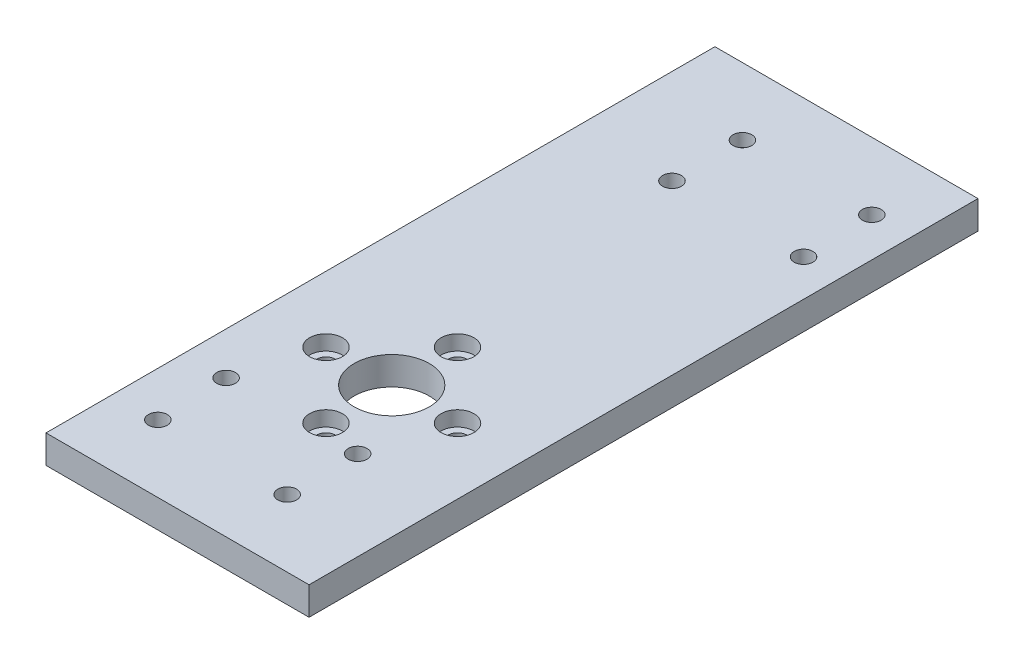
ISO-10303-21;
HEADER;
FILE_DESCRIPTION(('STEP AP214'),'2;1');
FILE_NAME('part.step','',(''),(''),'','','');
FILE_SCHEMA(('AUTOMOTIVE_DESIGN { 1 0 10303 214 1 1 1 1 }'));
ENDSEC;
DATA;
#1=APPLICATION_CONTEXT('core data for automotive mechanical design processes');
#2=APPLICATION_PROTOCOL_DEFINITION('international standard','automotive_design',2000,#1);
#3=PRODUCT_CONTEXT('',#1,'mechanical');
#4=PRODUCT('Part','Part','',(#3));
#5=PRODUCT_RELATED_PRODUCT_CATEGORY('part','',(#4));
#6=PRODUCT_DEFINITION_FORMATION('','',#4);
#7=PRODUCT_DEFINITION_CONTEXT('part definition',#1,'design');
#8=PRODUCT_DEFINITION('design','',#6,#7);
#9=PRODUCT_DEFINITION_SHAPE('','',#8);
#10=(LENGTH_UNIT() NAMED_UNIT(*) SI_UNIT(.MILLI.,.METRE.));
#11=(NAMED_UNIT(*) PLANE_ANGLE_UNIT() SI_UNIT($,.RADIAN.));
#12=(NAMED_UNIT(*) SI_UNIT($,.STERADIAN.) SOLID_ANGLE_UNIT());
#13=UNCERTAINTY_MEASURE_WITH_UNIT(LENGTH_MEASURE(1.E-05),#10,'distance_accuracy_value','');
#14=(GEOMETRIC_REPRESENTATION_CONTEXT(3) GLOBAL_UNCERTAINTY_ASSIGNED_CONTEXT((#13)) GLOBAL_UNIT_ASSIGNED_CONTEXT((#10,
#11,#12)) REPRESENTATION_CONTEXT('',''));
#15=CARTESIAN_POINT('',(0.,0.,0.));
#16=DIRECTION('',(0.,0.,1.));
#17=DIRECTION('',(1.,0.,0.));
#18=AXIS2_PLACEMENT_3D('',#15,#16,#17);
#19=CARTESIAN_POINT('',(-3.918775135,1.6,-20.948162882));
#20=DIRECTION('',(0.,1.,0.));
#21=DIRECTION('',(0.,0.,1.));
#22=AXIS2_PLACEMENT_3D('',#19,#20,#21);
#23=CYLINDRICAL_SURFACE('',#22,1.);
#24=CARTESIAN_POINT('',(-3.918775135,1.6,-20.948162882));
#25=DIRECTION('',(0.,1.,0.));
#26=DIRECTION('',(0.,0.,1.));
#27=AXIS2_PLACEMENT_3D('',#24,#25,#26);
#28=CIRCLE('',#27,1.);
#29=CARTESIAN_POINT('',(-3.918775135,1.6,-19.948162882));
#30=VERTEX_POINT('',#29);
#31=EDGE_CURVE('E210',#30,#30,#28,.T.);
#32=ORIENTED_EDGE('',*,*,#31,.F.);
#33=EDGE_LOOP('',(#32));
#34=FACE_BOUND('',#33,.T.);
#35=CARTESIAN_POINT('',(-3.918775135,3.,-20.948162882));
#36=DIRECTION('',(0.,1.,0.));
#37=DIRECTION('',(0.,0.,1.));
#38=AXIS2_PLACEMENT_3D('',#35,#36,#37);
#39=CIRCLE('',#38,1.);
#40=CARTESIAN_POINT('',(-3.918775135,3.,-19.948162882));
#41=VERTEX_POINT('',#40);
#42=EDGE_CURVE('E195',#41,#41,#39,.T.);
#43=ORIENTED_EDGE('',*,*,#42,.T.);
#44=EDGE_LOOP('',(#43));
#45=FACE_BOUND('',#44,.T.);
#46=ADVANCED_FACE('F17',(#34,#45),#23,.F.);
#47=CARTESIAN_POINT('',(10.081224865,1.6,-20.948162882));
#48=DIRECTION('',(0.,1.,0.));
#49=DIRECTION('',(0.,0.,1.));
#50=AXIS2_PLACEMENT_3D('',#47,#48,#49);
#51=CYLINDRICAL_SURFACE('',#50,1.);
#52=CARTESIAN_POINT('',(10.081224865,1.6,-20.948162882));
#53=DIRECTION('',(0.,1.,0.));
#54=DIRECTION('',(0.,0.,1.));
#55=AXIS2_PLACEMENT_3D('',#52,#53,#54);
#56=CIRCLE('',#55,1.);
#57=CARTESIAN_POINT('',(10.081224865,1.6,-19.948162882));
#58=VERTEX_POINT('',#57);
#59=EDGE_CURVE('E216',#58,#58,#56,.T.);
#60=ORIENTED_EDGE('',*,*,#59,.F.);
#61=EDGE_LOOP('',(#60));
#62=FACE_BOUND('',#61,.T.);
#63=CARTESIAN_POINT('',(10.081224865,3.,-20.948162882));
#64=DIRECTION('',(0.,1.,0.));
#65=DIRECTION('',(0.,0.,1.));
#66=AXIS2_PLACEMENT_3D('',#63,#64,#65);
#67=CIRCLE('',#66,1.);
#68=CARTESIAN_POINT('',(10.081224865,3.,-19.948162882));
#69=VERTEX_POINT('',#68);
#70=EDGE_CURVE('E192',#69,#69,#67,.T.);
#71=ORIENTED_EDGE('',*,*,#70,.T.);
#72=EDGE_LOOP('',(#71));
#73=FACE_BOUND('',#72,.T.);
#74=ADVANCED_FACE('F375',(#62,#73),#51,.F.);
#75=CARTESIAN_POINT('',(9.848832445,1.6,-28.448162882));
#76=DIRECTION('',(0.,1.,0.));
#77=DIRECTION('',(0.,0.,1.));
#78=AXIS2_PLACEMENT_3D('',#75,#76,#77);
#79=CYLINDRICAL_SURFACE('',#78,1.);
#80=CARTESIAN_POINT('',(9.848832445,1.6,-28.448162882));
#81=DIRECTION('',(0.,1.,0.));
#82=DIRECTION('',(0.,0.,1.));
#83=AXIS2_PLACEMENT_3D('',#80,#81,#82);
#84=CIRCLE('',#83,1.);
#85=CARTESIAN_POINT('',(9.848832445,1.6,-27.448162882));
#86=VERTEX_POINT('',#85);
#87=EDGE_CURVE('E213',#86,#86,#84,.T.);
#88=ORIENTED_EDGE('',*,*,#87,.F.);
#89=EDGE_LOOP('',(#88));
#90=FACE_BOUND('',#89,.T.);
#91=CARTESIAN_POINT('',(9.848832445,3.,-28.448162882));
#92=DIRECTION('',(0.,1.,0.));
#93=DIRECTION('',(0.,0.,1.));
#94=AXIS2_PLACEMENT_3D('',#91,#92,#93);
#95=CIRCLE('',#94,1.);
#96=CARTESIAN_POINT('',(9.848832445,3.,-27.448162882));
#97=VERTEX_POINT('',#96);
#98=EDGE_CURVE('E189',#97,#97,#95,.T.);
#99=ORIENTED_EDGE('',*,*,#98,.T.);
#100=EDGE_LOOP('',(#99));
#101=FACE_BOUND('',#100,.T.);
#102=ADVANCED_FACE('F238',(#90,#101),#79,.F.);
#103=CARTESIAN_POINT('',(4.518775135,1.6,20.948162882));
#104=DIRECTION('',(0.,1.,0.));
#105=DIRECTION('',(0.,0.,1.));
#106=AXIS2_PLACEMENT_3D('',#103,#104,#105);
#107=CYLINDRICAL_SURFACE('',#106,0.999999999999997);
#108=CARTESIAN_POINT('',(4.518775135,1.6,20.948162882));
#109=DIRECTION('',(0.,1.,0.));
#110=DIRECTION('',(0.,0.,1.));
#111=AXIS2_PLACEMENT_3D('',#108,#109,#110);
#112=CIRCLE('',#111,0.999999999999997);
#113=CARTESIAN_POINT('',(4.518775135,1.6,21.948162882));
#114=VERTEX_POINT('',#113);
#115=EDGE_CURVE('E21',#114,#114,#112,.T.);
#116=ORIENTED_EDGE('',*,*,#115,.F.);
#117=EDGE_LOOP('',(#116));
#118=FACE_BOUND('',#117,.T.);
#119=CARTESIAN_POINT('',(4.518775135,3.,20.948162882));
#120=DIRECTION('',(0.,1.,0.));
#121=DIRECTION('',(0.,0.,1.));
#122=AXIS2_PLACEMENT_3D('',#119,#120,#121);
#123=CIRCLE('',#122,0.999999999999997);
#124=CARTESIAN_POINT('',(4.518775135,3.,21.948162882));
#125=VERTEX_POINT('',#124);
#126=EDGE_CURVE('E186',#125,#125,#123,.T.);
#127=ORIENTED_EDGE('',*,*,#126,.T.);
#128=EDGE_LOOP('',(#127));
#129=FACE_BOUND('',#128,.T.);
#130=ADVANCED_FACE('F234',(#118,#129),#107,.F.);
#131=CARTESIAN_POINT('',(4.518775135,1.6,28.448162882));
#132=DIRECTION('',(0.,1.,0.));
#133=DIRECTION('',(0.,0.,1.));
#134=AXIS2_PLACEMENT_3D('',#131,#132,#133);
#135=CYLINDRICAL_SURFACE('',#134,0.999999999999997);
#136=CARTESIAN_POINT('',(4.518775135,1.6,28.448162882));
#137=DIRECTION('',(0.,1.,0.));
#138=DIRECTION('',(0.,0.,1.));
#139=AXIS2_PLACEMENT_3D('',#136,#137,#138);
#140=CIRCLE('',#139,0.999999999999997);
#141=CARTESIAN_POINT('',(4.518775135,1.6,29.448162882));
#142=VERTEX_POINT('',#141);
#143=EDGE_CURVE('E224',#142,#142,#140,.T.);
#144=ORIENTED_EDGE('',*,*,#143,.F.);
#145=EDGE_LOOP('',(#144));
#146=FACE_BOUND('',#145,.T.);
#147=CARTESIAN_POINT('',(4.518775135,3.,28.448162882));
#148=DIRECTION('',(0.,1.,0.));
#149=DIRECTION('',(0.,0.,1.));
#150=AXIS2_PLACEMENT_3D('',#147,#148,#149);
#151=CIRCLE('',#150,0.999999999999997);
#152=CARTESIAN_POINT('',(4.518775135,3.,29.448162882));
#153=VERTEX_POINT('',#152);
#154=EDGE_CURVE('E183',#153,#153,#151,.T.);
#155=ORIENTED_EDGE('',*,*,#154,.T.);
#156=EDGE_LOOP('',(#155));
#157=FACE_BOUND('',#156,.T.);
#158=ADVANCED_FACE('F237',(#146,#157),#135,.F.);
#159=CARTESIAN_POINT('',(-9.248832445,1.6,28.448162882));
#160=DIRECTION('',(0.,1.,0.));
#161=DIRECTION('',(0.,0.,1.));
#162=AXIS2_PLACEMENT_3D('',#159,#160,#161);
#163=CYLINDRICAL_SURFACE('',#162,0.999999999999997);
#164=CARTESIAN_POINT('',(-9.248832445,1.6,28.448162882));
#165=DIRECTION('',(0.,1.,0.));
#166=DIRECTION('',(0.,0.,1.));
#167=AXIS2_PLACEMENT_3D('',#164,#165,#166);
#168=CIRCLE('',#167,0.999999999999997);
#169=CARTESIAN_POINT('',(-9.248832445,1.6,29.448162882));
#170=VERTEX_POINT('',#169);
#171=EDGE_CURVE('E219',#170,#170,#168,.T.);
#172=ORIENTED_EDGE('',*,*,#171,.F.);
#173=EDGE_LOOP('',(#172));
#174=FACE_BOUND('',#173,.T.);
#175=CARTESIAN_POINT('',(-9.248832445,3.,28.448162882));
#176=DIRECTION('',(0.,1.,0.));
#177=DIRECTION('',(0.,0.,1.));
#178=AXIS2_PLACEMENT_3D('',#175,#176,#177);
#179=CIRCLE('',#178,0.999999999999997);
#180=CARTESIAN_POINT('',(-9.248832445,3.,29.448162882));
#181=VERTEX_POINT('',#180);
#182=EDGE_CURVE('E180',#181,#181,#179,.T.);
#183=ORIENTED_EDGE('',*,*,#182,.T.);
#184=EDGE_LOOP('',(#183));
#185=FACE_BOUND('',#184,.T.);
#186=ADVANCED_FACE('F365',(#174,#185),#163,.F.);
#187=CARTESIAN_POINT('',(-9.481224865,1.6,20.948162882));
#188=DIRECTION('',(0.,1.,0.));
#189=DIRECTION('',(0.,0.,1.));
#190=AXIS2_PLACEMENT_3D('',#187,#188,#189);
#191=CYLINDRICAL_SURFACE('',#190,0.999999999999997);
#192=CARTESIAN_POINT('',(-9.481224865,1.6,20.948162882));
#193=DIRECTION('',(0.,1.,0.));
#194=DIRECTION('',(0.,0.,1.));
#195=AXIS2_PLACEMENT_3D('',#192,#193,#194);
#196=CIRCLE('',#195,0.999999999999997);
#197=CARTESIAN_POINT('',(-9.481224865,1.6,21.948162882));
#198=VERTEX_POINT('',#197);
#199=EDGE_CURVE('E222',#198,#198,#196,.T.);
#200=ORIENTED_EDGE('',*,*,#199,.F.);
#201=EDGE_LOOP('',(#200));
#202=FACE_BOUND('',#201,.T.);
#203=CARTESIAN_POINT('',(-9.481224865,3.,20.948162882));
#204=DIRECTION('',(0.,1.,0.));
#205=DIRECTION('',(0.,0.,1.));
#206=AXIS2_PLACEMENT_3D('',#203,#204,#205);
#207=CIRCLE('',#206,0.999999999999997);
#208=CARTESIAN_POINT('',(-9.481224865,3.,21.948162882));
#209=VERTEX_POINT('',#208);
#210=EDGE_CURVE('E177',#209,#209,#207,.T.);
#211=ORIENTED_EDGE('',*,*,#210,.T.);
#212=EDGE_LOOP('',(#211));
#213=FACE_BOUND('',#212,.T.);
#214=ADVANCED_FACE('F361',(#202,#213),#191,.F.);
#215=CARTESIAN_POINT('',(-7.,1.4,12.8));
#216=DIRECTION('',(0.,1.,0.));
#217=DIRECTION('',(0.,0.,1.));
#218=AXIS2_PLACEMENT_3D('',#215,#216,#217);
#219=CYLINDRICAL_SURFACE('',#218,1.75);
#220=CARTESIAN_POINT('',(-7.,3.,12.8));
#221=DIRECTION('',(0.,1.,0.));
#222=DIRECTION('',(0.,0.,1.));
#223=AXIS2_PLACEMENT_3D('',#220,#221,#222);
#224=CIRCLE('',#223,1.75);
#225=CARTESIAN_POINT('',(-7.,3.,14.55));
#226=VERTEX_POINT('',#225);
#227=EDGE_CURVE('E204',#226,#226,#224,.T.);
#228=ORIENTED_EDGE('',*,*,#227,.T.);
#229=EDGE_LOOP('',(#228));
#230=FACE_BOUND('',#229,.T.);
#231=CARTESIAN_POINT('',(-7.,1.4,12.8));
#232=DIRECTION('',(0.,1.,0.));
#233=DIRECTION('',(0.,0.,1.));
#234=AXIS2_PLACEMENT_3D('',#231,#232,#233);
#235=CIRCLE('',#234,1.75);
#236=CARTESIAN_POINT('',(-7.,1.4,14.55));
#237=VERTEX_POINT('',#236);
#238=EDGE_CURVE('E174',#237,#237,#235,.T.);
#239=ORIENTED_EDGE('',*,*,#238,.F.);
#240=EDGE_LOOP('',(#239));
#241=FACE_BOUND('',#240,.T.);
#242=ADVANCED_FACE('F357',(#230,#241),#219,.F.);
#243=CARTESIAN_POINT('',(0.,1.4,19.8));
#244=DIRECTION('',(0.,1.,0.));
#245=DIRECTION('',(0.,0.,1.));
#246=AXIS2_PLACEMENT_3D('',#243,#244,#245);
#247=CYLINDRICAL_SURFACE('',#246,1.75);
#248=CARTESIAN_POINT('',(0.,3.,19.8));
#249=DIRECTION('',(0.,1.,0.));
#250=DIRECTION('',(0.,0.,1.));
#251=AXIS2_PLACEMENT_3D('',#248,#249,#250);
#252=CIRCLE('',#251,1.75);
#253=CARTESIAN_POINT('',(0.,3.,21.55));
#254=VERTEX_POINT('',#253);
#255=EDGE_CURVE('E198',#254,#254,#252,.T.);
#256=ORIENTED_EDGE('',*,*,#255,.T.);
#257=EDGE_LOOP('',(#256));
#258=FACE_BOUND('',#257,.T.);
#259=CARTESIAN_POINT('',(0.,1.4,19.8));
#260=DIRECTION('',(0.,1.,0.));
#261=DIRECTION('',(0.,0.,1.));
#262=AXIS2_PLACEMENT_3D('',#259,#260,#261);
#263=CIRCLE('',#262,1.75);
#264=CARTESIAN_POINT('',(0.,1.4,21.55));
#265=VERTEX_POINT('',#264);
#266=EDGE_CURVE('E171',#265,#265,#263,.T.);
#267=ORIENTED_EDGE('',*,*,#266,.F.);
#268=EDGE_LOOP('',(#267));
#269=FACE_BOUND('',#268,.T.);
#270=ADVANCED_FACE('F268',(#258,#269),#247,.F.);
#271=CARTESIAN_POINT('',(7.,1.4,12.8));
#272=DIRECTION('',(0.,1.,0.));
#273=DIRECTION('',(0.,0.,1.));
#274=AXIS2_PLACEMENT_3D('',#271,#272,#273);
#275=CYLINDRICAL_SURFACE('',#274,1.75);
#276=CARTESIAN_POINT('',(7.,3.,12.8));
#277=DIRECTION('',(0.,1.,0.));
#278=DIRECTION('',(0.,0.,1.));
#279=AXIS2_PLACEMENT_3D('',#276,#277,#278);
#280=CIRCLE('',#279,1.75);
#281=CARTESIAN_POINT('',(7.,3.,14.55));
#282=VERTEX_POINT('',#281);
#283=EDGE_CURVE('E207',#282,#282,#280,.T.);
#284=ORIENTED_EDGE('',*,*,#283,.T.);
#285=EDGE_LOOP('',(#284));
#286=FACE_BOUND('',#285,.T.);
#287=CARTESIAN_POINT('',(7.,1.4,12.8));
#288=DIRECTION('',(0.,1.,0.));
#289=DIRECTION('',(0.,0.,1.));
#290=AXIS2_PLACEMENT_3D('',#287,#288,#289);
#291=CIRCLE('',#290,1.75);
#292=CARTESIAN_POINT('',(7.,1.4,14.55));
#293=VERTEX_POINT('',#292);
#294=EDGE_CURVE('E168',#293,#293,#291,.T.);
#295=ORIENTED_EDGE('',*,*,#294,.F.);
#296=EDGE_LOOP('',(#295));
#297=FACE_BOUND('',#296,.T.);
#298=ADVANCED_FACE('F264',(#286,#297),#275,.F.);
#299=CARTESIAN_POINT('',(0.,1.4,5.8));
#300=DIRECTION('',(0.,1.,0.));
#301=DIRECTION('',(0.,0.,1.));
#302=AXIS2_PLACEMENT_3D('',#299,#300,#301);
#303=CYLINDRICAL_SURFACE('',#302,1.75);
#304=CARTESIAN_POINT('',(0.,3.,5.8));
#305=DIRECTION('',(0.,1.,0.));
#306=DIRECTION('',(0.,0.,1.));
#307=AXIS2_PLACEMENT_3D('',#304,#305,#306);
#308=CIRCLE('',#307,1.75);
#309=CARTESIAN_POINT('',(0.,3.,7.55));
#310=VERTEX_POINT('',#309);
#311=EDGE_CURVE('E201',#310,#310,#308,.T.);
#312=ORIENTED_EDGE('',*,*,#311,.T.);
#313=EDGE_LOOP('',(#312));
#314=FACE_BOUND('',#313,.T.);
#315=CARTESIAN_POINT('',(0.,1.4,5.8));
#316=DIRECTION('',(0.,1.,0.));
#317=DIRECTION('',(0.,0.,1.));
#318=AXIS2_PLACEMENT_3D('',#315,#316,#317);
#319=CIRCLE('',#318,1.75);
#320=CARTESIAN_POINT('',(0.,1.4,7.55));
#321=VERTEX_POINT('',#320);
#322=EDGE_CURVE('E165',#321,#321,#319,.T.);
#323=ORIENTED_EDGE('',*,*,#322,.F.);
#324=EDGE_LOOP('',(#323));
#325=FACE_BOUND('',#324,.T.);
#326=ADVANCED_FACE('F267',(#314,#325),#303,.F.);
#327=CARTESIAN_POINT('',(2.747775135,1.6,22.719162882));
#328=DIRECTION('',(0.,-1.,0.));
#329=DIRECTION('',(0.,0.,-1.));
#330=AXIS2_PLACEMENT_3D('',#327,#328,#329);
#331=PLANE('',#330);
#332=ORIENTED_EDGE('',*,*,#115,.T.);
#333=EDGE_LOOP('',(#332));
#334=FACE_BOUND('',#333,.T.);
#335=CARTESIAN_POINT('',(4.518775135,1.6,20.948162882));
#336=DIRECTION('',(0.,-1.,0.));
#337=DIRECTION('',(0.,0.,-1.));
#338=AXIS2_PLACEMENT_3D('',#335,#336,#337);
#339=CIRCLE('',#338,1.75);
#340=CARTESIAN_POINT('',(4.518775135,1.6,19.198162882));
#341=VERTEX_POINT('',#340);
#342=EDGE_CURVE('E159',#341,#341,#339,.F.);
#343=ORIENTED_EDGE('',*,*,#342,.F.);
#344=EDGE_LOOP('',(#343));
#345=FACE_BOUND('',#344,.T.);
#346=ADVANCED_FACE('F231',(#334,#345),#331,.T.);
#347=CARTESIAN_POINT('',(2.747775135,1.6,30.219162882));
#348=DIRECTION('',(0.,-1.,0.));
#349=DIRECTION('',(0.,0.,-1.));
#350=AXIS2_PLACEMENT_3D('',#347,#348,#349);
#351=PLANE('',#350);
#352=ORIENTED_EDGE('',*,*,#143,.T.);
#353=EDGE_LOOP('',(#352));
#354=FACE_BOUND('',#353,.T.);
#355=CARTESIAN_POINT('',(4.518775135,1.6,28.448162882));
#356=DIRECTION('',(0.,-1.,0.));
#357=DIRECTION('',(0.,0.,-1.));
#358=AXIS2_PLACEMENT_3D('',#355,#356,#357);
#359=CIRCLE('',#358,1.75);
#360=CARTESIAN_POINT('',(4.518775135,1.6,26.698162882));
#361=VERTEX_POINT('',#360);
#362=EDGE_CURVE('E156',#361,#361,#359,.F.);
#363=ORIENTED_EDGE('',*,*,#362,.F.);
#364=EDGE_LOOP('',(#363));
#365=FACE_BOUND('',#364,.T.);
#366=ADVANCED_FACE('F385',(#354,#365),#351,.T.);
#367=CARTESIAN_POINT('',(-11.252224865,1.6,22.719162882));
#368=DIRECTION('',(0.,-1.,0.));
#369=DIRECTION('',(0.,0.,-1.));
#370=AXIS2_PLACEMENT_3D('',#367,#368,#369);
#371=PLANE('',#370);
#372=ORIENTED_EDGE('',*,*,#199,.T.);
#373=EDGE_LOOP('',(#372));
#374=FACE_BOUND('',#373,.T.);
#375=CARTESIAN_POINT('',(-9.481224865,1.6,20.948162882));
#376=DIRECTION('',(0.,-1.,0.));
#377=DIRECTION('',(0.,0.,-1.));
#378=AXIS2_PLACEMENT_3D('',#375,#376,#377);
#379=CIRCLE('',#378,1.75);
#380=CARTESIAN_POINT('',(-9.481224865,1.6,19.198162882));
#381=VERTEX_POINT('',#380);
#382=EDGE_CURVE('E153',#381,#381,#379,.F.);
#383=ORIENTED_EDGE('',*,*,#382,.F.);
#384=EDGE_LOOP('',(#383));
#385=FACE_BOUND('',#384,.T.);
#386=ADVANCED_FACE('F388',(#374,#385),#371,.T.);
#387=CARTESIAN_POINT('',(-11.019832445,1.6,30.219162882));
#388=DIRECTION('',(0.,-1.,0.));
#389=DIRECTION('',(0.,0.,-1.));
#390=AXIS2_PLACEMENT_3D('',#387,#388,#389);
#391=PLANE('',#390);
#392=ORIENTED_EDGE('',*,*,#171,.T.);
#393=EDGE_LOOP('',(#392));
#394=FACE_BOUND('',#393,.T.);
#395=CARTESIAN_POINT('',(-9.248832445,1.6,28.448162882));
#396=DIRECTION('',(0.,-1.,0.));
#397=DIRECTION('',(0.,0.,-1.));
#398=AXIS2_PLACEMENT_3D('',#395,#396,#397);
#399=CIRCLE('',#398,1.75);
#400=CARTESIAN_POINT('',(-9.248832445,1.6,26.698162882));
#401=VERTEX_POINT('',#400);
#402=EDGE_CURVE('E150',#401,#401,#399,.F.);
#403=ORIENTED_EDGE('',*,*,#402,.F.);
#404=EDGE_LOOP('',(#403));
#405=FACE_BOUND('',#404,.T.);
#406=ADVANCED_FACE('F391',(#394,#405),#391,.T.);
#407=CARTESIAN_POINT('',(8.310224865,1.6,-19.177162882));
#408=DIRECTION('',(0.,-1.,0.));
#409=DIRECTION('',(0.,0.,-1.));
#410=AXIS2_PLACEMENT_3D('',#407,#408,#409);
#411=PLANE('',#410);
#412=ORIENTED_EDGE('',*,*,#59,.T.);
#413=EDGE_LOOP('',(#412));
#414=FACE_BOUND('',#413,.T.);
#415=CARTESIAN_POINT('',(10.081224865,1.6,-20.948162882));
#416=DIRECTION('',(0.,-1.,0.));
#417=DIRECTION('',(0.,0.,-1.));
#418=AXIS2_PLACEMENT_3D('',#415,#416,#417);
#419=CIRCLE('',#418,1.75);
#420=CARTESIAN_POINT('',(10.081224865,1.6,-22.698162882));
#421=VERTEX_POINT('',#420);
#422=EDGE_CURVE('E147',#421,#421,#419,.F.);
#423=ORIENTED_EDGE('',*,*,#422,.F.);
#424=EDGE_LOOP('',(#423));
#425=FACE_BOUND('',#424,.T.);
#426=ADVANCED_FACE('F395',(#414,#425),#411,.T.);
#427=CARTESIAN_POINT('',(8.077832445,1.6,-26.677162882));
#428=DIRECTION('',(0.,-1.,0.));
#429=DIRECTION('',(0.,0.,-1.));
#430=AXIS2_PLACEMENT_3D('',#427,#428,#429);
#431=PLANE('',#430);
#432=ORIENTED_EDGE('',*,*,#87,.T.);
#433=EDGE_LOOP('',(#432));
#434=FACE_BOUND('',#433,.T.);
#435=CARTESIAN_POINT('',(9.848832445,1.6,-28.448162882));
#436=DIRECTION('',(0.,-1.,0.));
#437=DIRECTION('',(0.,0.,-1.));
#438=AXIS2_PLACEMENT_3D('',#435,#436,#437);
#439=CIRCLE('',#438,1.75);
#440=CARTESIAN_POINT('',(9.848832445,1.6,-30.198162882));
#441=VERTEX_POINT('',#440);
#442=EDGE_CURVE('E144',#441,#441,#439,.F.);
#443=ORIENTED_EDGE('',*,*,#442,.F.);
#444=EDGE_LOOP('',(#443));
#445=FACE_BOUND('',#444,.T.);
#446=ADVANCED_FACE('F399',(#434,#445),#431,.T.);
#447=CARTESIAN_POINT('',(-5.689775135,1.6,-19.177162882));
#448=DIRECTION('',(0.,-1.,0.));
#449=DIRECTION('',(0.,0.,-1.));
#450=AXIS2_PLACEMENT_3D('',#447,#448,#449);
#451=PLANE('',#450);
#452=ORIENTED_EDGE('',*,*,#31,.T.);
#453=EDGE_LOOP('',(#452));
#454=FACE_BOUND('',#453,.T.);
#455=CARTESIAN_POINT('',(-3.918775135,1.6,-20.948162882));
#456=DIRECTION('',(0.,-1.,0.));
#457=DIRECTION('',(0.,0.,-1.));
#458=AXIS2_PLACEMENT_3D('',#455,#456,#457);
#459=CIRCLE('',#458,1.75);
#460=CARTESIAN_POINT('',(-3.918775135,1.6,-22.698162882));
#461=VERTEX_POINT('',#460);
#462=EDGE_CURVE('E141',#461,#461,#459,.F.);
#463=ORIENTED_EDGE('',*,*,#462,.F.);
#464=EDGE_LOOP('',(#463));
#465=FACE_BOUND('',#464,.T.);
#466=ADVANCED_FACE('F245',(#454,#465),#451,.T.);
#467=CARTESIAN_POINT('',(-14.,3.,35.6));
#468=DIRECTION('',(0.,-1.,0.));
#469=DIRECTION('',(0.,0.,-1.));
#470=AXIS2_PLACEMENT_3D('',#467,#468,#469);
#471=PLANE('',#470);
#472=CARTESIAN_POINT('',(0.,3.,12.8));
#473=DIRECTION('',(0.,1.,0.));
#474=DIRECTION('',(0.,0.,1.));
#475=AXIS2_PLACEMENT_3D('',#472,#473,#474);
#476=CIRCLE('',#475,4.);
#477=CARTESIAN_POINT('',(0.,3.,16.8));
#478=VERTEX_POINT('',#477);
#479=EDGE_CURVE('E138',#478,#478,#476,.T.);
#480=ORIENTED_EDGE('',*,*,#479,.F.);
#481=EDGE_LOOP('',(#480));
#482=FACE_BOUND('',#481,.T.);
#483=ORIENTED_EDGE('',*,*,#210,.F.);
#484=EDGE_LOOP('',(#483));
#485=FACE_BOUND('',#484,.T.);
#486=ORIENTED_EDGE('',*,*,#182,.F.);
#487=EDGE_LOOP('',(#486));
#488=FACE_BOUND('',#487,.T.);
#489=ORIENTED_EDGE('',*,*,#154,.F.);
#490=EDGE_LOOP('',(#489));
#491=FACE_BOUND('',#490,.T.);
#492=ORIENTED_EDGE('',*,*,#126,.F.);
#493=EDGE_LOOP('',(#492));
#494=FACE_BOUND('',#493,.T.);
#495=CARTESIAN_POINT('',(-3.918775135,3.,-28.448162882));
#496=DIRECTION('',(0.,1.,0.));
#497=DIRECTION('',(0.,0.,1.));
#498=AXIS2_PLACEMENT_3D('',#495,#496,#497);
#499=CIRCLE('',#498,1.);
#500=CARTESIAN_POINT('',(-3.918775135,3.,-27.448162882));
#501=VERTEX_POINT('',#500);
#502=EDGE_CURVE('E72',#501,#501,#499,.T.);
#503=ORIENTED_EDGE('',*,*,#502,.F.);
#504=EDGE_LOOP('',(#503));
#505=FACE_BOUND('',#504,.T.);
#506=ORIENTED_EDGE('',*,*,#98,.F.);
#507=EDGE_LOOP('',(#506));
#508=FACE_BOUND('',#507,.T.);
#509=ORIENTED_EDGE('',*,*,#70,.F.);
#510=EDGE_LOOP('',(#509));
#511=FACE_BOUND('',#510,.T.);
#512=ORIENTED_EDGE('',*,*,#42,.F.);
#513=EDGE_LOOP('',(#512));
#514=FACE_BOUND('',#513,.T.);
#515=ORIENTED_EDGE('',*,*,#255,.F.);
#516=EDGE_LOOP('',(#515));
#517=FACE_BOUND('',#516,.T.);
#518=ORIENTED_EDGE('',*,*,#311,.F.);
#519=EDGE_LOOP('',(#518));
#520=FACE_BOUND('',#519,.T.);
#521=ORIENTED_EDGE('',*,*,#227,.F.);
#522=EDGE_LOOP('',(#521));
#523=FACE_BOUND('',#522,.T.);
#524=ORIENTED_EDGE('',*,*,#283,.F.);
#525=EDGE_LOOP('',(#524));
#526=FACE_BOUND('',#525,.T.);
#527=DIRECTION('',(-1.,0.,0.));
#528=VECTOR('',#527,1.);
#529=CARTESIAN_POINT('',(0.,3.,-35.6));
#530=LINE('',#529,#528);
#531=CARTESIAN_POINT('',(14.,3.,-35.6));
#532=VERTEX_POINT('',#531);
#533=CARTESIAN_POINT('',(-14.,3.,-35.6));
#534=VERTEX_POINT('',#533);
#535=EDGE_CURVE('E580',#532,#534,#530,.T.);
#536=ORIENTED_EDGE('',*,*,#535,.T.);
#537=DIRECTION('',(0.,0.,1.));
#538=VECTOR('',#537,1.);
#539=CARTESIAN_POINT('',(-14.,3.,0.));
#540=LINE('',#539,#538);
#541=CARTESIAN_POINT('',(-14.,3.,35.6));
#542=VERTEX_POINT('',#541);
#543=EDGE_CURVE('E76',#534,#542,#540,.T.);
#544=ORIENTED_EDGE('',*,*,#543,.T.);
#545=DIRECTION('',(1.,0.,0.));
#546=VECTOR('',#545,1.);
#547=CARTESIAN_POINT('',(0.,3.,35.6));
#548=LINE('',#547,#546);
#549=CARTESIAN_POINT('',(14.,3.,35.6));
#550=VERTEX_POINT('',#549);
#551=EDGE_CURVE('E57',#542,#550,#548,.T.);
#552=ORIENTED_EDGE('',*,*,#551,.T.);
#553=DIRECTION('',(0.,0.,-1.));
#554=VECTOR('',#553,1.);
#555=CARTESIAN_POINT('',(14.,3.,0.));
#556=LINE('',#555,#554);
#557=EDGE_CURVE('E63',#550,#532,#556,.T.);
#558=ORIENTED_EDGE('',*,*,#557,.T.);
#559=EDGE_LOOP('',(#536,#544,#552,#558));
#560=FACE_BOUND('',#559,.T.);
#561=ADVANCED_FACE('F79',(#482,#485,#488,#491,#494,#505,#508,#511,#514,#517,#520,#523,#526,
#560),#471,.F.);
#562=CARTESIAN_POINT('',(-8.771,1.4,11.029));
#563=DIRECTION('',(0.,1.,0.));
#564=DIRECTION('',(0.,0.,1.));
#565=AXIS2_PLACEMENT_3D('',#562,#563,#564);
#566=PLANE('',#565);
#567=CARTESIAN_POINT('',(-7.,1.4,12.8));
#568=DIRECTION('',(0.,1.,0.));
#569=DIRECTION('',(0.,0.,1.));
#570=AXIS2_PLACEMENT_3D('',#567,#568,#569);
#571=CIRCLE('',#570,1.);
#572=CARTESIAN_POINT('',(-7.,1.4,13.8));
#573=VERTEX_POINT('',#572);
#574=EDGE_CURVE('E135',#573,#573,#571,.T.);
#575=ORIENTED_EDGE('',*,*,#574,.F.);
#576=EDGE_LOOP('',(#575));
#577=FACE_BOUND('',#576,.T.);
#578=ORIENTED_EDGE('',*,*,#238,.T.);
#579=EDGE_LOOP('',(#578));
#580=FACE_BOUND('',#579,.T.);
#581=ADVANCED_FACE('F244',(#577,#580),#566,.T.);
#582=CARTESIAN_POINT('',(-1.771,1.4,18.029));
#583=DIRECTION('',(0.,1.,0.));
#584=DIRECTION('',(0.,0.,1.));
#585=AXIS2_PLACEMENT_3D('',#582,#583,#584);
#586=PLANE('',#585);
#587=CARTESIAN_POINT('',(0.,1.4,19.8));
#588=DIRECTION('',(0.,1.,0.));
#589=DIRECTION('',(0.,0.,1.));
#590=AXIS2_PLACEMENT_3D('',#587,#588,#589);
#591=CIRCLE('',#590,1.);
#592=CARTESIAN_POINT('',(0.,1.4,20.8));
#593=VERTEX_POINT('',#592);
#594=EDGE_CURVE('E132',#593,#593,#591,.T.);
#595=ORIENTED_EDGE('',*,*,#594,.F.);
#596=EDGE_LOOP('',(#595));
#597=FACE_BOUND('',#596,.T.);
#598=ORIENTED_EDGE('',*,*,#266,.T.);
#599=EDGE_LOOP('',(#598));
#600=FACE_BOUND('',#599,.T.);
#601=ADVANCED_FACE('F275',(#597,#600),#586,.T.);
#602=CARTESIAN_POINT('',(5.229,1.4,11.029));
#603=DIRECTION('',(0.,1.,0.));
#604=DIRECTION('',(0.,0.,1.));
#605=AXIS2_PLACEMENT_3D('',#602,#603,#604);
#606=PLANE('',#605);
#607=CARTESIAN_POINT('',(7.,1.4,12.8));
#608=DIRECTION('',(0.,1.,0.));
#609=DIRECTION('',(0.,0.,1.));
#610=AXIS2_PLACEMENT_3D('',#607,#608,#609);
#611=CIRCLE('',#610,1.);
#612=CARTESIAN_POINT('',(7.,1.4,13.8));
#613=VERTEX_POINT('',#612);
#614=EDGE_CURVE('E129',#613,#613,#611,.T.);
#615=ORIENTED_EDGE('',*,*,#614,.F.);
#616=EDGE_LOOP('',(#615));
#617=FACE_BOUND('',#616,.T.);
#618=ORIENTED_EDGE('',*,*,#294,.T.);
#619=EDGE_LOOP('',(#618));
#620=FACE_BOUND('',#619,.T.);
#621=ADVANCED_FACE('F272',(#617,#620),#606,.T.);
#622=CARTESIAN_POINT('',(-1.771,1.4,4.029));
#623=DIRECTION('',(0.,1.,0.));
#624=DIRECTION('',(0.,0.,1.));
#625=AXIS2_PLACEMENT_3D('',#622,#623,#624);
#626=PLANE('',#625);
#627=CARTESIAN_POINT('',(0.,1.4,5.8));
#628=DIRECTION('',(0.,1.,0.));
#629=DIRECTION('',(0.,0.,1.));
#630=AXIS2_PLACEMENT_3D('',#627,#628,#629);
#631=CIRCLE('',#630,1.);
#632=CARTESIAN_POINT('',(0.,1.4,6.8));
#633=VERTEX_POINT('',#632);
#634=EDGE_CURVE('E126',#633,#633,#631,.T.);
#635=ORIENTED_EDGE('',*,*,#634,.F.);
#636=EDGE_LOOP('',(#635));
#637=FACE_BOUND('',#636,.T.);
#638=ORIENTED_EDGE('',*,*,#322,.T.);
#639=EDGE_LOOP('',(#638));
#640=FACE_BOUND('',#639,.T.);
#641=ADVANCED_FACE('F274',(#637,#640),#626,.T.);
#642=CARTESIAN_POINT('',(-3.918775135,1.6,-28.448162882));
#643=DIRECTION('',(0.,1.,0.));
#644=DIRECTION('',(0.,0.,1.));
#645=AXIS2_PLACEMENT_3D('',#642,#643,#644);
#646=CYLINDRICAL_SURFACE('',#645,1.);
#647=ORIENTED_EDGE('',*,*,#502,.T.);
#648=EDGE_LOOP('',(#647));
#649=FACE_BOUND('',#648,.T.);
#650=CARTESIAN_POINT('',(-3.918775135,1.6,-28.448162882));
#651=DIRECTION('',(0.,1.,0.));
#652=DIRECTION('',(0.,0.,1.));
#653=AXIS2_PLACEMENT_3D('',#650,#651,#652);
#654=CIRCLE('',#653,1.);
#655=CARTESIAN_POINT('',(-3.918775135,1.6,-27.448162882));
#656=VERTEX_POINT('',#655);
#657=EDGE_CURVE('E122',#656,#656,#654,.T.);
#658=ORIENTED_EDGE('',*,*,#657,.F.);
#659=EDGE_LOOP('',(#658));
#660=FACE_BOUND('',#659,.T.);
#661=ADVANCED_FACE('F283',(#649,#660),#646,.F.);
#662=CARTESIAN_POINT('',(14.,0.,-35.6));
#663=DIRECTION('',(-1.,0.,0.));
#664=DIRECTION('',(0.,0.,1.));
#665=AXIS2_PLACEMENT_3D('',#662,#663,#664);
#666=PLANE('',#665);
#667=DIRECTION('',(0.,1.,0.));
#668=VECTOR('',#667,1.);
#669=CARTESIAN_POINT('',(14.,1.5,-35.6));
#670=LINE('',#669,#668);
#671=CARTESIAN_POINT('',(14.,0.,-35.6));
#672=VERTEX_POINT('',#671);
#673=EDGE_CURVE('E68',#672,#532,#670,.T.);
#674=ORIENTED_EDGE('',*,*,#673,.T.);
#675=ORIENTED_EDGE('',*,*,#557,.F.);
#676=DIRECTION('',(0.,-1.,0.));
#677=VECTOR('',#676,1.);
#678=CARTESIAN_POINT('',(14.,1.5,35.6));
#679=LINE('',#678,#677);
#680=CARTESIAN_POINT('',(14.,0.,35.6));
#681=VERTEX_POINT('',#680);
#682=EDGE_CURVE('E66',#550,#681,#679,.T.);
#683=ORIENTED_EDGE('',*,*,#682,.T.);
#684=DIRECTION('',(0.,0.,1.));
#685=VECTOR('',#684,1.);
#686=CARTESIAN_POINT('',(14.,0.,0.));
#687=LINE('',#686,#685);
#688=EDGE_CURVE('E125',#672,#681,#687,.T.);
#689=ORIENTED_EDGE('',*,*,#688,.F.);
#690=EDGE_LOOP('',(#674,#675,#683,#689));
#691=FACE_BOUND('',#690,.T.);
#692=ADVANCED_FACE('F64',(#691),#666,.F.);
#693=CARTESIAN_POINT('',(14.,0.,35.6));
#694=DIRECTION('',(0.,0.,-1.));
#695=DIRECTION('',(-1.,0.,0.));
#696=AXIS2_PLACEMENT_3D('',#693,#694,#695);
#697=PLANE('',#696);
#698=ORIENTED_EDGE('',*,*,#682,.F.);
#699=ORIENTED_EDGE('',*,*,#551,.F.);
#700=DIRECTION('',(0.,-1.,0.));
#701=VECTOR('',#700,1.);
#702=CARTESIAN_POINT('',(-14.,1.5,35.6));
#703=LINE('',#702,#701);
#704=CARTESIAN_POINT('',(-14.,0.,35.6));
#705=VERTEX_POINT('',#704);
#706=EDGE_CURVE('E583',#542,#705,#703,.T.);
#707=ORIENTED_EDGE('',*,*,#706,.T.);
#708=DIRECTION('',(-1.,0.,0.));
#709=VECTOR('',#708,1.);
#710=CARTESIAN_POINT('',(0.,0.,35.6));
#711=LINE('',#710,#709);
#712=EDGE_CURVE('E75',#681,#705,#711,.T.);
#713=ORIENTED_EDGE('',*,*,#712,.F.);
#714=EDGE_LOOP('',(#698,#699,#707,#713));
#715=FACE_BOUND('',#714,.T.);
#716=ADVANCED_FACE('F74',(#715),#697,.F.);
#717=CARTESIAN_POINT('',(-14.,0.,35.6));
#718=DIRECTION('',(1.,0.,0.));
#719=DIRECTION('',(0.,0.,-1.));
#720=AXIS2_PLACEMENT_3D('',#717,#718,#719);
#721=PLANE('',#720);
#722=ORIENTED_EDGE('',*,*,#706,.F.);
#723=ORIENTED_EDGE('',*,*,#543,.F.);
#724=DIRECTION('',(0.,-1.,0.));
#725=VECTOR('',#724,1.);
#726=CARTESIAN_POINT('',(-14.,1.5,-35.6));
#727=LINE('',#726,#725);
#728=CARTESIAN_POINT('',(-14.,0.,-35.6));
#729=VERTEX_POINT('',#728);
#730=EDGE_CURVE('E162',#534,#729,#727,.T.);
#731=ORIENTED_EDGE('',*,*,#730,.T.);
#732=DIRECTION('',(0.,0.,-1.));
#733=VECTOR('',#732,1.);
#734=CARTESIAN_POINT('',(-14.,0.,0.));
#735=LINE('',#734,#733);
#736=EDGE_CURVE('E36',#705,#729,#735,.T.);
#737=ORIENTED_EDGE('',*,*,#736,.F.);
#738=EDGE_LOOP('',(#722,#723,#731,#737));
#739=FACE_BOUND('',#738,.T.);
#740=ADVANCED_FACE('F460',(#739),#721,.F.);
#741=CARTESIAN_POINT('',(-14.,0.,-35.6));
#742=DIRECTION('',(0.,0.,1.));
#743=DIRECTION('',(1.,0.,0.));
#744=AXIS2_PLACEMENT_3D('',#741,#742,#743);
#745=PLANE('',#744);
#746=ORIENTED_EDGE('',*,*,#730,.F.);
#747=ORIENTED_EDGE('',*,*,#535,.F.);
#748=ORIENTED_EDGE('',*,*,#673,.F.);
#749=DIRECTION('',(1.,0.,0.));
#750=VECTOR('',#749,1.);
#751=CARTESIAN_POINT('',(0.,0.,-35.6));
#752=LINE('',#751,#750);
#753=EDGE_CURVE('E121',#729,#672,#752,.T.);
#754=ORIENTED_EDGE('',*,*,#753,.F.);
#755=EDGE_LOOP('',(#746,#747,#748,#754));
#756=FACE_BOUND('',#755,.T.);
#757=ADVANCED_FACE('F347',(#756),#745,.F.);
#758=CARTESIAN_POINT('',(4.518775135,1.6,20.948162882));
#759=DIRECTION('',(0.,-1.,0.));
#760=DIRECTION('',(0.,0.,-1.));
#761=AXIS2_PLACEMENT_3D('',#758,#759,#760);
#762=CYLINDRICAL_SURFACE('',#761,1.75);
#763=CARTESIAN_POINT('',(4.518775135,0.,20.948162882));
#764=DIRECTION('',(0.,-1.,0.));
#765=DIRECTION('',(0.,0.,-1.));
#766=AXIS2_PLACEMENT_3D('',#763,#764,#765);
#767=CIRCLE('',#766,1.75);
#768=CARTESIAN_POINT('',(4.518775135,0.,19.198162882));
#769=VERTEX_POINT('',#768);
#770=EDGE_CURVE('E118',#769,#769,#767,.F.);
#771=ORIENTED_EDGE('',*,*,#770,.F.);
#772=EDGE_LOOP('',(#771));
#773=FACE_BOUND('',#772,.T.);
#774=ORIENTED_EDGE('',*,*,#342,.T.);
#775=EDGE_LOOP('',(#774));
#776=FACE_BOUND('',#775,.T.);
#777=ADVANCED_FACE('F343',(#773,#776),#762,.F.);
#778=CARTESIAN_POINT('',(4.518775135,1.6,28.448162882));
#779=DIRECTION('',(0.,-1.,0.));
#780=DIRECTION('',(0.,0.,-1.));
#781=AXIS2_PLACEMENT_3D('',#778,#779,#780);
#782=CYLINDRICAL_SURFACE('',#781,1.75);
#783=CARTESIAN_POINT('',(4.518775135,0.,28.448162882));
#784=DIRECTION('',(0.,-1.,0.));
#785=DIRECTION('',(0.,0.,-1.));
#786=AXIS2_PLACEMENT_3D('',#783,#784,#785);
#787=CIRCLE('',#786,1.75);
#788=CARTESIAN_POINT('',(4.518775135,0.,26.698162882));
#789=VERTEX_POINT('',#788);
#790=EDGE_CURVE('E115',#789,#789,#787,.F.);
#791=ORIENTED_EDGE('',*,*,#790,.F.);
#792=EDGE_LOOP('',(#791));
#793=FACE_BOUND('',#792,.T.);
#794=ORIENTED_EDGE('',*,*,#362,.T.);
#795=EDGE_LOOP('',(#794));
#796=FACE_BOUND('',#795,.T.);
#797=ADVANCED_FACE('F339',(#793,#796),#782,.F.);
#798=CARTESIAN_POINT('',(-9.481224865,1.6,20.948162882));
#799=DIRECTION('',(0.,-1.,0.));
#800=DIRECTION('',(0.,0.,-1.));
#801=AXIS2_PLACEMENT_3D('',#798,#799,#800);
#802=CYLINDRICAL_SURFACE('',#801,1.75);
#803=CARTESIAN_POINT('',(-9.481224865,0.,20.948162882));
#804=DIRECTION('',(0.,-1.,0.));
#805=DIRECTION('',(0.,0.,-1.));
#806=AXIS2_PLACEMENT_3D('',#803,#804,#805);
#807=CIRCLE('',#806,1.75);
#808=CARTESIAN_POINT('',(-9.481224865,0.,19.198162882));
#809=VERTEX_POINT('',#808);
#810=EDGE_CURVE('E112',#809,#809,#807,.F.);
#811=ORIENTED_EDGE('',*,*,#810,.F.);
#812=EDGE_LOOP('',(#811));
#813=FACE_BOUND('',#812,.T.);
#814=ORIENTED_EDGE('',*,*,#382,.T.);
#815=EDGE_LOOP('',(#814));
#816=FACE_BOUND('',#815,.T.);
#817=ADVANCED_FACE('F335',(#813,#816),#802,.F.);
#818=CARTESIAN_POINT('',(-9.248832445,1.6,28.448162882));
#819=DIRECTION('',(0.,-1.,0.));
#820=DIRECTION('',(0.,0.,-1.));
#821=AXIS2_PLACEMENT_3D('',#818,#819,#820);
#822=CYLINDRICAL_SURFACE('',#821,1.75);
#823=CARTESIAN_POINT('',(-9.248832445,0.,28.448162882));
#824=DIRECTION('',(0.,-1.,0.));
#825=DIRECTION('',(0.,0.,-1.));
#826=AXIS2_PLACEMENT_3D('',#823,#824,#825);
#827=CIRCLE('',#826,1.75);
#828=CARTESIAN_POINT('',(-9.248832445,0.,26.698162882));
#829=VERTEX_POINT('',#828);
#830=EDGE_CURVE('E109',#829,#829,#827,.F.);
#831=ORIENTED_EDGE('',*,*,#830,.F.);
#832=EDGE_LOOP('',(#831));
#833=FACE_BOUND('',#832,.T.);
#834=ORIENTED_EDGE('',*,*,#402,.T.);
#835=EDGE_LOOP('',(#834));
#836=FACE_BOUND('',#835,.T.);
#837=ADVANCED_FACE('F331',(#833,#836),#822,.F.);
#838=CARTESIAN_POINT('',(10.081224865,1.6,-20.948162882));
#839=DIRECTION('',(0.,-1.,0.));
#840=DIRECTION('',(0.,0.,-1.));
#841=AXIS2_PLACEMENT_3D('',#838,#839,#840);
#842=CYLINDRICAL_SURFACE('',#841,1.75);
#843=CARTESIAN_POINT('',(10.081224865,0.,-20.948162882));
#844=DIRECTION('',(0.,-1.,0.));
#845=DIRECTION('',(0.,0.,-1.));
#846=AXIS2_PLACEMENT_3D('',#843,#844,#845);
#847=CIRCLE('',#846,1.75);
#848=CARTESIAN_POINT('',(10.081224865,0.,-22.698162882));
#849=VERTEX_POINT('',#848);
#850=EDGE_CURVE('E106',#849,#849,#847,.F.);
#851=ORIENTED_EDGE('',*,*,#850,.F.);
#852=EDGE_LOOP('',(#851));
#853=FACE_BOUND('',#852,.T.);
#854=ORIENTED_EDGE('',*,*,#422,.T.);
#855=EDGE_LOOP('',(#854));
#856=FACE_BOUND('',#855,.T.);
#857=ADVANCED_FACE('F327',(#853,#856),#842,.F.);
#858=CARTESIAN_POINT('',(9.848832445,1.6,-28.448162882));
#859=DIRECTION('',(0.,-1.,0.));
#860=DIRECTION('',(0.,0.,-1.));
#861=AXIS2_PLACEMENT_3D('',#858,#859,#860);
#862=CYLINDRICAL_SURFACE('',#861,1.75);
#863=CARTESIAN_POINT('',(9.848832445,0.,-28.448162882));
#864=DIRECTION('',(0.,-1.,0.));
#865=DIRECTION('',(0.,0.,-1.));
#866=AXIS2_PLACEMENT_3D('',#863,#864,#865);
#867=CIRCLE('',#866,1.75);
#868=CARTESIAN_POINT('',(9.848832445,0.,-30.198162882));
#869=VERTEX_POINT('',#868);
#870=EDGE_CURVE('E103',#869,#869,#867,.F.);
#871=ORIENTED_EDGE('',*,*,#870,.F.);
#872=EDGE_LOOP('',(#871));
#873=FACE_BOUND('',#872,.T.);
#874=ORIENTED_EDGE('',*,*,#442,.T.);
#875=EDGE_LOOP('',(#874));
#876=FACE_BOUND('',#875,.T.);
#877=ADVANCED_FACE('F323',(#873,#876),#862,.F.);
#878=CARTESIAN_POINT('',(-3.918775135,1.6,-20.948162882));
#879=DIRECTION('',(0.,-1.,0.));
#880=DIRECTION('',(0.,0.,-1.));
#881=AXIS2_PLACEMENT_3D('',#878,#879,#880);
#882=CYLINDRICAL_SURFACE('',#881,1.75);
#883=CARTESIAN_POINT('',(-3.918775135,0.,-20.948162882));
#884=DIRECTION('',(0.,-1.,0.));
#885=DIRECTION('',(0.,0.,-1.));
#886=AXIS2_PLACEMENT_3D('',#883,#884,#885);
#887=CIRCLE('',#886,1.75);
#888=CARTESIAN_POINT('',(-3.918775135,0.,-22.698162882));
#889=VERTEX_POINT('',#888);
#890=EDGE_CURVE('E100',#889,#889,#887,.F.);
#891=ORIENTED_EDGE('',*,*,#890,.F.);
#892=EDGE_LOOP('',(#891));
#893=FACE_BOUND('',#892,.T.);
#894=ORIENTED_EDGE('',*,*,#462,.T.);
#895=EDGE_LOOP('',(#894));
#896=FACE_BOUND('',#895,.T.);
#897=ADVANCED_FACE('F319',(#893,#896),#882,.F.);
#898=CARTESIAN_POINT('',(0.,0.,12.8));
#899=DIRECTION('',(0.,1.,0.));
#900=DIRECTION('',(0.,0.,1.));
#901=AXIS2_PLACEMENT_3D('',#898,#899,#900);
#902=CYLINDRICAL_SURFACE('',#901,4.);
#903=CARTESIAN_POINT('',(0.,0.,12.8));
#904=DIRECTION('',(0.,1.,0.));
#905=DIRECTION('',(0.,0.,1.));
#906=AXIS2_PLACEMENT_3D('',#903,#904,#905);
#907=CIRCLE('',#906,4.);
#908=CARTESIAN_POINT('',(0.,0.,16.8));
#909=VERTEX_POINT('',#908);
#910=EDGE_CURVE('E97',#909,#909,#907,.T.);
#911=ORIENTED_EDGE('',*,*,#910,.F.);
#912=EDGE_LOOP('',(#911));
#913=FACE_BOUND('',#912,.T.);
#914=ORIENTED_EDGE('',*,*,#479,.T.);
#915=EDGE_LOOP('',(#914));
#916=FACE_BOUND('',#915,.T.);
#917=ADVANCED_FACE('F315',(#913,#916),#902,.F.);
#918=CARTESIAN_POINT('',(-7.,0.,12.8));
#919=DIRECTION('',(0.,1.,0.));
#920=DIRECTION('',(0.,0.,1.));
#921=AXIS2_PLACEMENT_3D('',#918,#919,#920);
#922=CYLINDRICAL_SURFACE('',#921,1.);
#923=CARTESIAN_POINT('',(-7.,0.,12.8));
#924=DIRECTION('',(0.,1.,0.));
#925=DIRECTION('',(0.,0.,1.));
#926=AXIS2_PLACEMENT_3D('',#923,#924,#925);
#927=CIRCLE('',#926,1.);
#928=CARTESIAN_POINT('',(-7.,0.,13.8));
#929=VERTEX_POINT('',#928);
#930=EDGE_CURVE('E94',#929,#929,#927,.T.);
#931=ORIENTED_EDGE('',*,*,#930,.F.);
#932=EDGE_LOOP('',(#931));
#933=FACE_BOUND('',#932,.T.);
#934=ORIENTED_EDGE('',*,*,#574,.T.);
#935=EDGE_LOOP('',(#934));
#936=FACE_BOUND('',#935,.T.);
#937=ADVANCED_FACE('F311',(#933,#936),#922,.F.);
#938=CARTESIAN_POINT('',(0.,0.,19.8));
#939=DIRECTION('',(0.,1.,0.));
#940=DIRECTION('',(0.,0.,1.));
#941=AXIS2_PLACEMENT_3D('',#938,#939,#940);
#942=CYLINDRICAL_SURFACE('',#941,1.);
#943=CARTESIAN_POINT('',(0.,0.,19.8));
#944=DIRECTION('',(0.,1.,0.));
#945=DIRECTION('',(0.,0.,1.));
#946=AXIS2_PLACEMENT_3D('',#943,#944,#945);
#947=CIRCLE('',#946,1.);
#948=CARTESIAN_POINT('',(0.,0.,20.8));
#949=VERTEX_POINT('',#948);
#950=EDGE_CURVE('E91',#949,#949,#947,.T.);
#951=ORIENTED_EDGE('',*,*,#950,.F.);
#952=EDGE_LOOP('',(#951));
#953=FACE_BOUND('',#952,.T.);
#954=ORIENTED_EDGE('',*,*,#594,.T.);
#955=EDGE_LOOP('',(#954));
#956=FACE_BOUND('',#955,.T.);
#957=ADVANCED_FACE('F307',(#953,#956),#942,.F.);
#958=CARTESIAN_POINT('',(7.,0.,12.8));
#959=DIRECTION('',(0.,1.,0.));
#960=DIRECTION('',(0.,0.,1.));
#961=AXIS2_PLACEMENT_3D('',#958,#959,#960);
#962=CYLINDRICAL_SURFACE('',#961,1.);
#963=CARTESIAN_POINT('',(7.,0.,12.8));
#964=DIRECTION('',(0.,1.,0.));
#965=DIRECTION('',(0.,0.,1.));
#966=AXIS2_PLACEMENT_3D('',#963,#964,#965);
#967=CIRCLE('',#966,1.);
#968=CARTESIAN_POINT('',(7.,0.,13.8));
#969=VERTEX_POINT('',#968);
#970=EDGE_CURVE('E88',#969,#969,#967,.T.);
#971=ORIENTED_EDGE('',*,*,#970,.F.);
#972=EDGE_LOOP('',(#971));
#973=FACE_BOUND('',#972,.T.);
#974=ORIENTED_EDGE('',*,*,#614,.T.);
#975=EDGE_LOOP('',(#974));
#976=FACE_BOUND('',#975,.T.);
#977=ADVANCED_FACE('F303',(#973,#976),#962,.F.);
#978=CARTESIAN_POINT('',(0.,0.,5.8));
#979=DIRECTION('',(0.,1.,0.));
#980=DIRECTION('',(0.,0.,1.));
#981=AXIS2_PLACEMENT_3D('',#978,#979,#980);
#982=CYLINDRICAL_SURFACE('',#981,1.);
#983=CARTESIAN_POINT('',(0.,0.,5.8));
#984=DIRECTION('',(0.,1.,0.));
#985=DIRECTION('',(0.,0.,1.));
#986=AXIS2_PLACEMENT_3D('',#983,#984,#985);
#987=CIRCLE('',#986,1.);
#988=CARTESIAN_POINT('',(0.,0.,6.8));
#989=VERTEX_POINT('',#988);
#990=EDGE_CURVE('E85',#989,#989,#987,.T.);
#991=ORIENTED_EDGE('',*,*,#990,.F.);
#992=EDGE_LOOP('',(#991));
#993=FACE_BOUND('',#992,.T.);
#994=ORIENTED_EDGE('',*,*,#634,.T.);
#995=EDGE_LOOP('',(#994));
#996=FACE_BOUND('',#995,.T.);
#997=ADVANCED_FACE('F300',(#993,#996),#982,.F.);
#998=CARTESIAN_POINT('',(-5.689775135,1.6,-26.677162882));
#999=DIRECTION('',(0.,-1.,0.));
#1000=DIRECTION('',(0.,0.,-1.));
#1001=AXIS2_PLACEMENT_3D('',#998,#999,#1000);
#1002=PLANE('',#1001);
#1003=ORIENTED_EDGE('',*,*,#657,.T.);
#1004=EDGE_LOOP('',(#1003));
#1005=FACE_BOUND('',#1004,.T.);
#1006=CARTESIAN_POINT('',(-3.918775135,1.6,-28.448162882));
#1007=DIRECTION('',(0.,-1.,0.));
#1008=DIRECTION('',(0.,0.,-1.));
#1009=AXIS2_PLACEMENT_3D('',#1006,#1007,#1008);
#1010=CIRCLE('',#1009,1.75);
#1011=CARTESIAN_POINT('',(-3.918775135,1.6,-30.198162882));
#1012=VERTEX_POINT('',#1011);
#1013=EDGE_CURVE('E27',#1012,#1012,#1010,.F.);
#1014=ORIENTED_EDGE('',*,*,#1013,.F.);
#1015=EDGE_LOOP('',(#1014));
#1016=FACE_BOUND('',#1015,.T.);
#1017=ADVANCED_FACE('F296',(#1005,#1016),#1002,.T.);
#1018=CARTESIAN_POINT('',(-14.,0.,35.6));
#1019=DIRECTION('',(0.,-1.,0.));
#1020=DIRECTION('',(0.,0.,-1.));
#1021=AXIS2_PLACEMENT_3D('',#1018,#1019,#1020);
#1022=PLANE('',#1021);
#1023=ORIENTED_EDGE('',*,*,#990,.T.);
#1024=EDGE_LOOP('',(#1023));
#1025=FACE_BOUND('',#1024,.T.);
#1026=ORIENTED_EDGE('',*,*,#970,.T.);
#1027=EDGE_LOOP('',(#1026));
#1028=FACE_BOUND('',#1027,.T.);
#1029=ORIENTED_EDGE('',*,*,#950,.T.);
#1030=EDGE_LOOP('',(#1029));
#1031=FACE_BOUND('',#1030,.T.);
#1032=ORIENTED_EDGE('',*,*,#930,.T.);
#1033=EDGE_LOOP('',(#1032));
#1034=FACE_BOUND('',#1033,.T.);
#1035=ORIENTED_EDGE('',*,*,#910,.T.);
#1036=EDGE_LOOP('',(#1035));
#1037=FACE_BOUND('',#1036,.T.);
#1038=ORIENTED_EDGE('',*,*,#890,.T.);
#1039=EDGE_LOOP('',(#1038));
#1040=FACE_BOUND('',#1039,.T.);
#1041=ORIENTED_EDGE('',*,*,#870,.T.);
#1042=EDGE_LOOP('',(#1041));
#1043=FACE_BOUND('',#1042,.T.);
#1044=ORIENTED_EDGE('',*,*,#850,.T.);
#1045=EDGE_LOOP('',(#1044));
#1046=FACE_BOUND('',#1045,.T.);
#1047=ORIENTED_EDGE('',*,*,#830,.T.);
#1048=EDGE_LOOP('',(#1047));
#1049=FACE_BOUND('',#1048,.T.);
#1050=ORIENTED_EDGE('',*,*,#810,.T.);
#1051=EDGE_LOOP('',(#1050));
#1052=FACE_BOUND('',#1051,.T.);
#1053=ORIENTED_EDGE('',*,*,#790,.T.);
#1054=EDGE_LOOP('',(#1053));
#1055=FACE_BOUND('',#1054,.T.);
#1056=ORIENTED_EDGE('',*,*,#770,.T.);
#1057=EDGE_LOOP('',(#1056));
#1058=FACE_BOUND('',#1057,.T.);
#1059=CARTESIAN_POINT('',(-3.918775135,0.,-28.448162882));
#1060=DIRECTION('',(0.,-1.,0.));
#1061=DIRECTION('',(0.,0.,-1.));
#1062=AXIS2_PLACEMENT_3D('',#1059,#1060,#1061);
#1063=CIRCLE('',#1062,1.75);
#1064=CARTESIAN_POINT('',(-3.918775135,0.,-30.198162882));
#1065=VERTEX_POINT('',#1064);
#1066=EDGE_CURVE('E11',#1065,#1065,#1063,.T.);
#1067=ORIENTED_EDGE('',*,*,#1066,.F.);
#1068=EDGE_LOOP('',(#1067));
#1069=FACE_BOUND('',#1068,.T.);
#1070=ORIENTED_EDGE('',*,*,#736,.T.);
#1071=ORIENTED_EDGE('',*,*,#753,.T.);
#1072=ORIENTED_EDGE('',*,*,#688,.T.);
#1073=ORIENTED_EDGE('',*,*,#712,.T.);
#1074=EDGE_LOOP('',(#1070,#1071,#1072,#1073));
#1075=FACE_BOUND('',#1074,.T.);
#1076=ADVANCED_FACE('F19',(#1025,#1028,#1031,#1034,#1037,#1040,#1043,#1046,#1049,#1052,#1055,
#1058,#1069,#1075),#1022,.T.);
#1077=CARTESIAN_POINT('',(-3.918775135,1.6,-28.448162882));
#1078=DIRECTION('',(0.,-1.,0.));
#1079=DIRECTION('',(0.,0.,-1.));
#1080=AXIS2_PLACEMENT_3D('',#1077,#1078,#1079);
#1081=CYLINDRICAL_SURFACE('',#1080,1.75);
#1082=ORIENTED_EDGE('',*,*,#1013,.T.);
#1083=EDGE_LOOP('',(#1082));
#1084=FACE_BOUND('',#1083,.T.);
#1085=ORIENTED_EDGE('',*,*,#1066,.T.);
#1086=EDGE_LOOP('',(#1085));
#1087=FACE_BOUND('',#1086,.T.);
#1088=ADVANCED_FACE('F289',(#1084,#1087),#1081,.F.);
#1089=CLOSED_SHELL('',(#46,#74,#102,#130,#158,#186,#214,#242,#270,#298,#326,#346,#366,#386,#406,
#426,#446,#466,#561,#581,#601,#621,#641,#661,#692,#716,#740,#757,#777,#797,#817,#837,#857,#877,
#897,#917,#937,#957,#977,#997,#1017,#1076,#1088));
#1090=MANIFOLD_SOLID_BREP('B1',#1089);
#1091=ADVANCED_BREP_SHAPE_REPRESENTATION('',(#18,#1090),#14);
#1092=SHAPE_DEFINITION_REPRESENTATION(#9,#1091);
ENDSEC;
END-ISO-10303-21;
